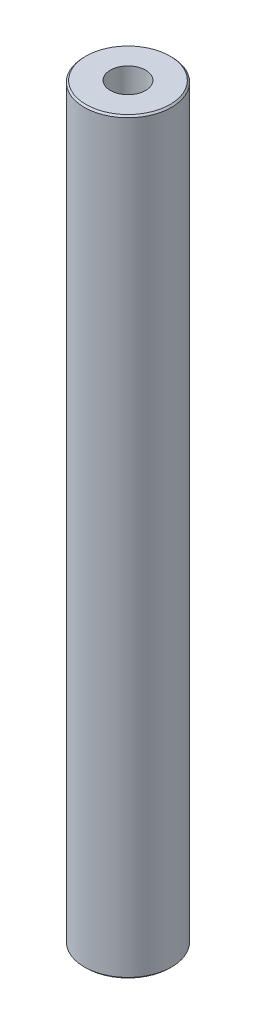
ISO-10303-21;
HEADER;
FILE_DESCRIPTION(('STEP AP214'),'2;1');
FILE_NAME('part.step','',(''),(''),'','','');
FILE_SCHEMA(('AUTOMOTIVE_DESIGN { 1 0 10303 214 1 1 1 1 }'));
ENDSEC;
DATA;
#1=APPLICATION_CONTEXT('core data for automotive mechanical design processes');
#2=APPLICATION_PROTOCOL_DEFINITION('international standard','automotive_design',2000,#1);
#3=PRODUCT_CONTEXT('',#1,'mechanical');
#4=PRODUCT('Part','Part','',(#3));
#5=PRODUCT_RELATED_PRODUCT_CATEGORY('part','',(#4));
#6=PRODUCT_DEFINITION_FORMATION('','',#4);
#7=PRODUCT_DEFINITION_CONTEXT('part definition',#1,'design');
#8=PRODUCT_DEFINITION('design','',#6,#7);
#9=PRODUCT_DEFINITION_SHAPE('','',#8);
#10=(LENGTH_UNIT() NAMED_UNIT(*) SI_UNIT(.MILLI.,.METRE.));
#11=(NAMED_UNIT(*) PLANE_ANGLE_UNIT() SI_UNIT($,.RADIAN.));
#12=(NAMED_UNIT(*) SI_UNIT($,.STERADIAN.) SOLID_ANGLE_UNIT());
#13=UNCERTAINTY_MEASURE_WITH_UNIT(LENGTH_MEASURE(1.E-05),#10,'distance_accuracy_value','');
#14=(GEOMETRIC_REPRESENTATION_CONTEXT(3) GLOBAL_UNCERTAINTY_ASSIGNED_CONTEXT((#13)) GLOBAL_UNIT_ASSIGNED_CONTEXT((#10,
#11,#12)) REPRESENTATION_CONTEXT('',''));
#15=CARTESIAN_POINT('',(0.,0.,0.));
#16=DIRECTION('',(0.,0.,1.));
#17=DIRECTION('',(1.,0.,0.));
#18=AXIS2_PLACEMENT_3D('',#15,#16,#17);
#19=CARTESIAN_POINT('',(0.,600.,0.));
#20=DIRECTION('',(0.,-1.,0.));
#21=DIRECTION('',(0.,0.,-1.));
#22=AXIS2_PLACEMENT_3D('',#19,#20,#21);
#23=CYLINDRICAL_SURFACE('',#22,35.);
#24=CARTESIAN_POINT('',(0.,598.694643168469,0.));
#25=DIRECTION('',(0.,1.,0.));
#26=DIRECTION('',(0.,0.,1.));
#27=AXIS2_PLACEMENT_3D('',#24,#25,#26);
#28=CIRCLE('',#27,35.);
#29=CARTESIAN_POINT('',(0.,598.694643168469,35.));
#30=VERTEX_POINT('',#29);
#31=EDGE_CURVE('E50',#30,#30,#28,.F.);
#32=ORIENTED_EDGE('',*,*,#31,.T.);
#33=EDGE_LOOP('',(#32));
#34=FACE_BOUND('',#33,.T.);
#35=CARTESIAN_POINT('',(0.,1.30535683153088,0.));
#36=DIRECTION('',(0.,1.,0.));
#37=DIRECTION('',(0.,0.,1.));
#38=AXIS2_PLACEMENT_3D('',#35,#36,#37);
#39=CIRCLE('',#38,35.);
#40=CARTESIAN_POINT('',(0.,1.30535683153088,35.));
#41=VERTEX_POINT('',#40);
#42=EDGE_CURVE('E51',#41,#41,#39,.T.);
#43=ORIENTED_EDGE('',*,*,#42,.T.);
#44=EDGE_LOOP('',(#43));
#45=FACE_BOUND('',#44,.T.);
#46=ADVANCED_FACE('F39',(#34,#45),#23,.T.);
#47=CARTESIAN_POINT('',(0.,600.,0.));
#48=DIRECTION('',(0.,1.,0.));
#49=DIRECTION('',(0.,0.,1.));
#50=AXIS2_PLACEMENT_3D('',#47,#48,#49);
#51=PLANE('',#50);
#52=CARTESIAN_POINT('',(0.,600.,0.));
#53=DIRECTION('',(0.,1.,0.));
#54=DIRECTION('',(0.,0.,1.));
#55=AXIS2_PLACEMENT_3D('',#52,#53,#54);
#56=CIRCLE('',#55,33.694643168469);
#57=CARTESIAN_POINT('',(0.,600.,33.694643168469));
#58=VERTEX_POINT('',#57);
#59=EDGE_CURVE('E54',#58,#58,#56,.T.);
#60=ORIENTED_EDGE('',*,*,#59,.T.);
#61=EDGE_LOOP('',(#60));
#62=FACE_BOUND('',#61,.T.);
#63=CARTESIAN_POINT('',(0.,600.,0.));
#64=DIRECTION('',(0.,1.,0.));
#65=DIRECTION('',(0.,0.,1.));
#66=AXIS2_PLACEMENT_3D('',#63,#64,#65);
#67=CIRCLE('',#66,14.1686721865051);
#68=CARTESIAN_POINT('',(0.,600.,14.1686721865051));
#69=VERTEX_POINT('',#68);
#70=EDGE_CURVE('E58',#69,#69,#67,.T.);
#71=ORIENTED_EDGE('',*,*,#70,.F.);
#72=EDGE_LOOP('',(#71));
#73=FACE_BOUND('',#72,.T.);
#74=ADVANCED_FACE('F69',(#62,#73),#51,.T.);
#75=CARTESIAN_POINT('',(0.,0.,0.));
#76=DIRECTION('',(0.,1.,0.));
#77=DIRECTION('',(0.,0.,1.));
#78=AXIS2_PLACEMENT_3D('',#75,#76,#77);
#79=PLANE('',#78);
#80=CARTESIAN_POINT('',(0.,0.,0.));
#81=DIRECTION('',(0.,1.,0.));
#82=DIRECTION('',(0.,0.,1.));
#83=AXIS2_PLACEMENT_3D('',#80,#81,#82);
#84=CIRCLE('',#83,33.6946431684691);
#85=CARTESIAN_POINT('',(0.,0.,33.6946431684691));
#86=VERTEX_POINT('',#85);
#87=EDGE_CURVE('E10',#86,#86,#84,.F.);
#88=ORIENTED_EDGE('',*,*,#87,.T.);
#89=EDGE_LOOP('',(#88));
#90=FACE_BOUND('',#89,.T.);
#91=CARTESIAN_POINT('',(0.,0.,0.));
#92=DIRECTION('',(0.,1.,0.));
#93=DIRECTION('',(0.,0.,1.));
#94=AXIS2_PLACEMENT_3D('',#91,#92,#93);
#95=CIRCLE('',#94,14.1686721865051);
#96=CARTESIAN_POINT('',(0.,0.,14.1686721865051));
#97=VERTEX_POINT('',#96);
#98=EDGE_CURVE('E63',#97,#97,#95,.T.);
#99=ORIENTED_EDGE('',*,*,#98,.T.);
#100=EDGE_LOOP('',(#99));
#101=FACE_BOUND('',#100,.T.);
#102=ADVANCED_FACE('F75',(#90,#101),#79,.F.);
#103=CARTESIAN_POINT('',(0.,600.,0.));
#104=DIRECTION('',(0.,-1.,0.));
#105=DIRECTION('',(0.,0.,-1.));
#106=AXIS2_PLACEMENT_3D('',#103,#104,#105);
#107=CYLINDRICAL_SURFACE('',#106,14.1686721865051);
#108=ORIENTED_EDGE('',*,*,#70,.T.);
#109=EDGE_LOOP('',(#108));
#110=FACE_BOUND('',#109,.T.);
#111=ORIENTED_EDGE('',*,*,#98,.F.);
#112=EDGE_LOOP('',(#111));
#113=FACE_BOUND('',#112,.T.);
#114=ADVANCED_FACE('F70',(#110,#113),#107,.F.);
#115=CARTESIAN_POINT('',(0.,600.,0.));
#116=DIRECTION('',(0.,-1.,0.));
#117=DIRECTION('',(0.,0.,-1.));
#118=AXIS2_PLACEMENT_3D('',#115,#116,#117);
#119=CONICAL_SURFACE('',#118,33.694643168469,0.785398163397462);
#120=ORIENTED_EDGE('',*,*,#31,.F.);
#121=EDGE_LOOP('',(#120));
#122=FACE_BOUND('',#121,.T.);
#123=ORIENTED_EDGE('',*,*,#59,.F.);
#124=EDGE_LOOP('',(#123));
#125=FACE_BOUND('',#124,.T.);
#126=ADVANCED_FACE('F81',(#122,#125),#119,.T.);
#127=CARTESIAN_POINT('',(0.,1.30535683153088,0.));
#128=DIRECTION('',(0.,1.,0.));
#129=DIRECTION('',(0.,0.,1.));
#130=AXIS2_PLACEMENT_3D('',#127,#128,#129);
#131=CONICAL_SURFACE('',#130,35.,0.785398163397462);
#132=ORIENTED_EDGE('',*,*,#87,.F.);
#133=EDGE_LOOP('',(#132));
#134=FACE_BOUND('',#133,.T.);
#135=ORIENTED_EDGE('',*,*,#42,.F.);
#136=EDGE_LOOP('',(#135));
#137=FACE_BOUND('',#136,.T.);
#138=ADVANCED_FACE('F45',(#134,#137),#131,.T.);
#139=CLOSED_SHELL('',(#46,#74,#102,#114,#126,#138));
#140=MANIFOLD_SOLID_BREP('B2',#139);
#141=ADVANCED_BREP_SHAPE_REPRESENTATION('',(#18,#140),#14);
#142=SHAPE_DEFINITION_REPRESENTATION(#9,#141);
ENDSEC;
END-ISO-10303-21;
